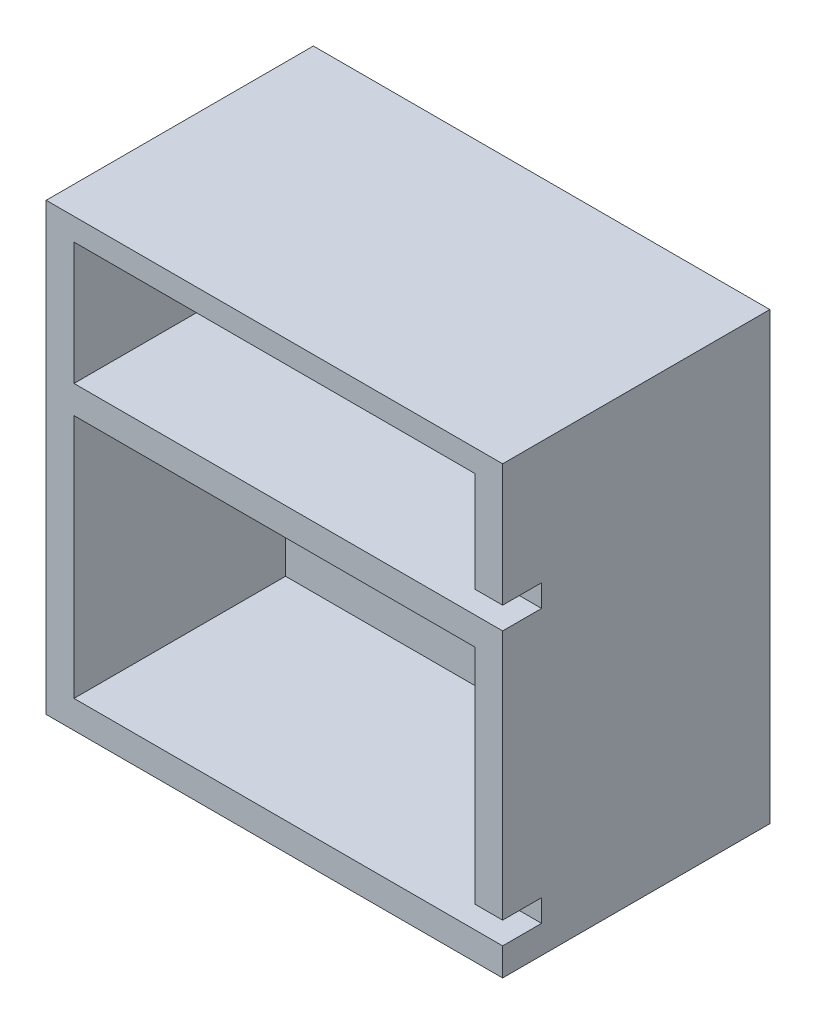
ISO-10303-21;
HEADER;
FILE_DESCRIPTION(('STEP AP214'),'2;1');
FILE_NAME('part.step','',(''),(''),'','','');
FILE_SCHEMA(('AUTOMOTIVE_DESIGN { 1 0 10303 214 1 1 1 1 }'));
ENDSEC;
DATA;
#1=APPLICATION_CONTEXT('core data for automotive mechanical design processes');
#2=APPLICATION_PROTOCOL_DEFINITION('international standard','automotive_design',2000,#1);
#3=PRODUCT_CONTEXT('',#1,'mechanical');
#4=PRODUCT('Part','Part','',(#3));
#5=PRODUCT_RELATED_PRODUCT_CATEGORY('part','',(#4));
#6=PRODUCT_DEFINITION_FORMATION('','',#4);
#7=PRODUCT_DEFINITION_CONTEXT('part definition',#1,'design');
#8=PRODUCT_DEFINITION('design','',#6,#7);
#9=PRODUCT_DEFINITION_SHAPE('','',#8);
#10=(LENGTH_UNIT() NAMED_UNIT(*) SI_UNIT(.MILLI.,.METRE.));
#11=(NAMED_UNIT(*) PLANE_ANGLE_UNIT() SI_UNIT($,.RADIAN.));
#12=(NAMED_UNIT(*) SI_UNIT($,.STERADIAN.) SOLID_ANGLE_UNIT());
#13=UNCERTAINTY_MEASURE_WITH_UNIT(LENGTH_MEASURE(1.E-05),#10,'distance_accuracy_value','');
#14=(GEOMETRIC_REPRESENTATION_CONTEXT(3) GLOBAL_UNCERTAINTY_ASSIGNED_CONTEXT((#13)) GLOBAL_UNIT_ASSIGNED_CONTEXT((#10,
#11,#12)) REPRESENTATION_CONTEXT('',''));
#15=CARTESIAN_POINT('',(0.,0.,0.));
#16=DIRECTION('',(0.,0.,1.));
#17=DIRECTION('',(1.,0.,0.));
#18=AXIS2_PLACEMENT_3D('',#15,#16,#17);
#19=CARTESIAN_POINT('',(41.,80.,-24.));
#20=DIRECTION('',(-1.,0.,0.));
#21=DIRECTION('',(0.,0.,1.));
#22=AXIS2_PLACEMENT_3D('',#19,#20,#21);
#23=PLANE('',#22);
#24=DIRECTION('',(0.,-1.,0.));
#25=VECTOR('',#24,1.);
#26=CARTESIAN_POINT('',(41.,80.,24.));
#27=LINE('',#26,#25);
#28=CARTESIAN_POINT('',(41.,54.,24.));
#29=VERTEX_POINT('',#28);
#30=CARTESIAN_POINT('',(41.,9.00000000000001,24.));
#31=VERTEX_POINT('',#30);
#32=EDGE_CURVE('E187',#29,#31,#27,.T.);
#33=ORIENTED_EDGE('',*,*,#32,.T.);
#34=DIRECTION('',(0.,0.,1.));
#35=VECTOR('',#34,1.);
#36=CARTESIAN_POINT('',(41.,9.00000000000001,17.));
#37=LINE('',#36,#35);
#38=CARTESIAN_POINT('',(41.,9.00000000000001,17.));
#39=VERTEX_POINT('',#38);
#40=EDGE_CURVE('E306',#39,#31,#37,.T.);
#41=ORIENTED_EDGE('',*,*,#40,.F.);
#42=DIRECTION('',(0.,1.,0.));
#43=VECTOR('',#42,1.);
#44=CARTESIAN_POINT('',(41.,9.00000000000001,17.));
#45=LINE('',#44,#43);
#46=CARTESIAN_POINT('',(41.,5.,17.));
#47=VERTEX_POINT('',#46);
#48=EDGE_CURVE('E178',#47,#39,#45,.T.);
#49=ORIENTED_EDGE('',*,*,#48,.F.);
#50=DIRECTION('',(0.,0.,-1.));
#51=VECTOR('',#50,1.);
#52=CARTESIAN_POINT('',(41.,5.,17.));
#53=LINE('',#52,#51);
#54=CARTESIAN_POINT('',(41.,5.,24.));
#55=VERTEX_POINT('',#54);
#56=EDGE_CURVE('E160',#55,#47,#53,.T.);
#57=ORIENTED_EDGE('',*,*,#56,.F.);
#58=CARTESIAN_POINT('',(41.,0.,24.));
#59=VERTEX_POINT('',#58);
#60=EDGE_CURVE('E174',#55,#59,#27,.T.);
#61=ORIENTED_EDGE('',*,*,#60,.T.);
#62=DIRECTION('',(0.,0.,-1.));
#63=VECTOR('',#62,1.);
#64=CARTESIAN_POINT('',(41.,0.,-24.));
#65=LINE('',#64,#63);
#66=CARTESIAN_POINT('',(41.,0.,-24.));
#67=VERTEX_POINT('',#66);
#68=EDGE_CURVE('E215',#59,#67,#65,.T.);
#69=ORIENTED_EDGE('',*,*,#68,.T.);
#70=DIRECTION('',(0.,-1.,0.));
#71=VECTOR('',#70,1.);
#72=CARTESIAN_POINT('',(41.,80.,-24.));
#73=LINE('',#72,#71);
#74=CARTESIAN_POINT('',(41.,80.,-24.));
#75=VERTEX_POINT('',#74);
#76=EDGE_CURVE('E11',#75,#67,#73,.T.);
#77=ORIENTED_EDGE('',*,*,#76,.F.);
#78=DIRECTION('',(0.,0.,-1.));
#79=VECTOR('',#78,1.);
#80=CARTESIAN_POINT('',(41.,80.,-24.));
#81=LINE('',#80,#79);
#82=CARTESIAN_POINT('',(41.,80.,24.));
#83=VERTEX_POINT('',#82);
#84=EDGE_CURVE('E214',#83,#75,#81,.T.);
#85=ORIENTED_EDGE('',*,*,#84,.F.);
#86=CARTESIAN_POINT('',(41.,58.,24.));
#87=VERTEX_POINT('',#86);
#88=EDGE_CURVE('E190',#83,#87,#27,.T.);
#89=ORIENTED_EDGE('',*,*,#88,.T.);
#90=DIRECTION('',(0.,0.,1.));
#91=VECTOR('',#90,1.);
#92=CARTESIAN_POINT('',(41.,58.,17.));
#93=LINE('',#92,#91);
#94=CARTESIAN_POINT('',(41.,58.,17.));
#95=VERTEX_POINT('',#94);
#96=EDGE_CURVE('E286',#95,#87,#93,.T.);
#97=ORIENTED_EDGE('',*,*,#96,.F.);
#98=DIRECTION('',(0.,1.,0.));
#99=VECTOR('',#98,1.);
#100=CARTESIAN_POINT('',(41.,58.,17.));
#101=LINE('',#100,#99);
#102=CARTESIAN_POINT('',(41.,54.,17.));
#103=VERTEX_POINT('',#102);
#104=EDGE_CURVE('E292',#103,#95,#101,.T.);
#105=ORIENTED_EDGE('',*,*,#104,.F.);
#106=DIRECTION('',(0.,0.,-1.));
#107=VECTOR('',#106,1.);
#108=CARTESIAN_POINT('',(41.,54.,17.));
#109=LINE('',#108,#107);
#110=EDGE_CURVE('E295',#29,#103,#109,.T.);
#111=ORIENTED_EDGE('',*,*,#110,.F.);
#112=EDGE_LOOP('',(#33,#41,#49,#57,#61,#69,#77,#85,#89,#97,#105,#111));
#113=FACE_BOUND('',#112,.T.);
#114=ADVANCED_FACE('F33',(#113),#23,.F.);
#115=CARTESIAN_POINT('',(-41.,80.,-24.));
#116=DIRECTION('',(0.,0.,1.));
#117=DIRECTION('',(1.,0.,0.));
#118=AXIS2_PLACEMENT_3D('',#115,#116,#117);
#119=PLANE('',#118);
#120=CARTESIAN_POINT('',(-20.9999999999996,24.,-24.));
#121=DIRECTION('',(0.,0.,1.));
#122=DIRECTION('',(1.,0.,0.));
#123=AXIS2_PLACEMENT_3D('',#120,#121,#122);
#124=CIRCLE('',#123,2.25);
#125=CARTESIAN_POINT('',(-18.7499999999996,24.,-24.));
#126=VERTEX_POINT('',#125);
#127=EDGE_CURVE('E345',#126,#126,#124,.F.);
#128=ORIENTED_EDGE('',*,*,#127,.F.);
#129=EDGE_LOOP('',(#128));
#130=FACE_BOUND('',#129,.T.);
#131=CARTESIAN_POINT('',(15.0000000000004,24.,-24.));
#132=DIRECTION('',(0.,0.,1.));
#133=DIRECTION('',(1.,0.,0.));
#134=AXIS2_PLACEMENT_3D('',#131,#132,#133);
#135=CIRCLE('',#134,2.25);
#136=CARTESIAN_POINT('',(17.2500000000004,24.,-24.));
#137=VERTEX_POINT('',#136);
#138=EDGE_CURVE('E352',#137,#137,#135,.F.);
#139=ORIENTED_EDGE('',*,*,#138,.F.);
#140=EDGE_LOOP('',(#139));
#141=FACE_BOUND('',#140,.T.);
#142=CARTESIAN_POINT('',(15.,60.,-24.));
#143=DIRECTION('',(0.,0.,1.));
#144=DIRECTION('',(1.,0.,0.));
#145=AXIS2_PLACEMENT_3D('',#142,#143,#144);
#146=CIRCLE('',#145,2.25);
#147=CARTESIAN_POINT('',(17.25,60.,-24.));
#148=VERTEX_POINT('',#147);
#149=EDGE_CURVE('E344',#148,#148,#146,.F.);
#150=ORIENTED_EDGE('',*,*,#149,.F.);
#151=EDGE_LOOP('',(#150));
#152=FACE_BOUND('',#151,.T.);
#153=CARTESIAN_POINT('',(-21.,60.,-24.));
#154=DIRECTION('',(0.,0.,1.));
#155=DIRECTION('',(1.,0.,0.));
#156=AXIS2_PLACEMENT_3D('',#153,#154,#155);
#157=CIRCLE('',#156,2.25);
#158=CARTESIAN_POINT('',(-18.75,60.,-24.));
#159=VERTEX_POINT('',#158);
#160=EDGE_CURVE('E325',#159,#159,#157,.F.);
#161=ORIENTED_EDGE('',*,*,#160,.F.);
#162=EDGE_LOOP('',(#161));
#163=FACE_BOUND('',#162,.T.);
#164=DIRECTION('',(-1.,0.,0.));
#165=VECTOR('',#164,1.);
#166=CARTESIAN_POINT('',(-41.,0.,-24.));
#167=LINE('',#166,#165);
#168=CARTESIAN_POINT('',(-41.,0.,-24.));
#169=VERTEX_POINT('',#168);
#170=EDGE_CURVE('E212',#67,#169,#167,.T.);
#171=ORIENTED_EDGE('',*,*,#170,.T.);
#172=DIRECTION('',(0.,-1.,0.));
#173=VECTOR('',#172,1.);
#174=CARTESIAN_POINT('',(-41.,80.,-24.));
#175=LINE('',#174,#173);
#176=CARTESIAN_POINT('',(-41.,80.,-24.));
#177=VERTEX_POINT('',#176);
#178=EDGE_CURVE('E40',#177,#169,#175,.T.);
#179=ORIENTED_EDGE('',*,*,#178,.F.);
#180=DIRECTION('',(-1.,0.,0.));
#181=VECTOR('',#180,1.);
#182=CARTESIAN_POINT('',(-41.,80.,-24.));
#183=LINE('',#182,#181);
#184=EDGE_CURVE('E221',#75,#177,#183,.T.);
#185=ORIENTED_EDGE('',*,*,#184,.F.);
#186=ORIENTED_EDGE('',*,*,#76,.T.);
#187=EDGE_LOOP('',(#171,#179,#185,#186));
#188=FACE_BOUND('',#187,.T.);
#189=ADVANCED_FACE('F374',(#130,#141,#152,#163,#188),#119,.F.);
#190=CARTESIAN_POINT('',(-41.,80.,-24.));
#191=DIRECTION('',(1.,0.,0.));
#192=DIRECTION('',(0.,0.,-1.));
#193=AXIS2_PLACEMENT_3D('',#190,#191,#192);
#194=PLANE('',#193);
#195=DIRECTION('',(0.,0.,1.));
#196=VECTOR('',#195,1.);
#197=CARTESIAN_POINT('',(-41.,0.,-24.));
#198=LINE('',#197,#196);
#199=CARTESIAN_POINT('',(-41.,0.,24.));
#200=VERTEX_POINT('',#199);
#201=EDGE_CURVE('E208',#169,#200,#198,.T.);
#202=ORIENTED_EDGE('',*,*,#201,.T.);
#203=DIRECTION('',(0.,-1.,0.));
#204=VECTOR('',#203,1.);
#205=CARTESIAN_POINT('',(-41.,80.,24.));
#206=LINE('',#205,#204);
#207=CARTESIAN_POINT('',(-41.,80.,24.));
#208=VERTEX_POINT('',#207);
#209=EDGE_CURVE('E196',#208,#200,#206,.T.);
#210=ORIENTED_EDGE('',*,*,#209,.F.);
#211=DIRECTION('',(0.,0.,1.));
#212=VECTOR('',#211,1.);
#213=CARTESIAN_POINT('',(-41.,80.,-24.));
#214=LINE('',#213,#212);
#215=EDGE_CURVE('E191',#177,#208,#214,.T.);
#216=ORIENTED_EDGE('',*,*,#215,.F.);
#217=ORIENTED_EDGE('',*,*,#178,.T.);
#218=EDGE_LOOP('',(#202,#210,#216,#217));
#219=FACE_BOUND('',#218,.T.);
#220=ADVANCED_FACE('F207',(#219),#194,.F.);
#221=CARTESIAN_POINT('',(-41.,80.,24.));
#222=DIRECTION('',(0.,0.,-1.));
#223=DIRECTION('',(-1.,0.,0.));
#224=AXIS2_PLACEMENT_3D('',#221,#222,#223);
#225=PLANE('',#224);
#226=DIRECTION('',(0.,1.,0.));
#227=VECTOR('',#226,1.);
#228=CARTESIAN_POINT('',(36.,49.,24.));
#229=LINE('',#228,#227);
#230=CARTESIAN_POINT('',(36.,9.00000000000001,24.));
#231=VERTEX_POINT('',#230);
#232=CARTESIAN_POINT('',(36.,49.,24.));
#233=VERTEX_POINT('',#232);
#234=EDGE_CURVE('E236',#231,#233,#229,.T.);
#235=ORIENTED_EDGE('',*,*,#234,.F.);
#236=DIRECTION('',(1.,0.,0.));
#237=VECTOR('',#236,1.);
#238=CARTESIAN_POINT('',(-41.001,9.00000000000001,24.));
#239=LINE('',#238,#237);
#240=EDGE_CURVE('E248',#231,#31,#239,.T.);
#241=ORIENTED_EDGE('',*,*,#240,.T.);
#242=ORIENTED_EDGE('',*,*,#32,.F.);
#243=DIRECTION('',(1.,0.,0.));
#244=VECTOR('',#243,1.);
#245=CARTESIAN_POINT('',(-36.,54.,24.));
#246=LINE('',#245,#244);
#247=CARTESIAN_POINT('',(-36.,54.,24.));
#248=VERTEX_POINT('',#247);
#249=EDGE_CURVE('E237',#248,#29,#246,.T.);
#250=ORIENTED_EDGE('',*,*,#249,.F.);
#251=DIRECTION('',(0.,-1.,0.));
#252=VECTOR('',#251,1.);
#253=CARTESIAN_POINT('',(-36.,76.,24.));
#254=LINE('',#253,#252);
#255=CARTESIAN_POINT('',(-36.,76.,24.));
#256=VERTEX_POINT('',#255);
#257=EDGE_CURVE('E240',#256,#248,#254,.T.);
#258=ORIENTED_EDGE('',*,*,#257,.F.);
#259=DIRECTION('',(-1.,0.,0.));
#260=VECTOR('',#259,1.);
#261=CARTESIAN_POINT('',(-36.,76.,24.));
#262=LINE('',#261,#260);
#263=CARTESIAN_POINT('',(36.,76.,24.));
#264=VERTEX_POINT('',#263);
#265=EDGE_CURVE('E243',#264,#256,#262,.T.);
#266=ORIENTED_EDGE('',*,*,#265,.F.);
#267=DIRECTION('',(0.,1.,0.));
#268=VECTOR('',#267,1.);
#269=CARTESIAN_POINT('',(36.,76.,24.));
#270=LINE('',#269,#268);
#271=CARTESIAN_POINT('',(36.,58.,24.));
#272=VERTEX_POINT('',#271);
#273=EDGE_CURVE('E246',#272,#264,#270,.T.);
#274=ORIENTED_EDGE('',*,*,#273,.F.);
#275=DIRECTION('',(1.,0.,0.));
#276=VECTOR('',#275,1.);
#277=CARTESIAN_POINT('',(-41.001,58.,24.));
#278=LINE('',#277,#276);
#279=EDGE_CURVE('E288',#272,#87,#278,.T.);
#280=ORIENTED_EDGE('',*,*,#279,.T.);
#281=ORIENTED_EDGE('',*,*,#88,.F.);
#282=DIRECTION('',(1.,0.,0.));
#283=VECTOR('',#282,1.);
#284=CARTESIAN_POINT('',(-41.,80.,24.));
#285=LINE('',#284,#283);
#286=EDGE_CURVE('E188',#208,#83,#285,.T.);
#287=ORIENTED_EDGE('',*,*,#286,.F.);
#288=ORIENTED_EDGE('',*,*,#209,.T.);
#289=DIRECTION('',(1.,0.,0.));
#290=VECTOR('',#289,1.);
#291=CARTESIAN_POINT('',(-41.,0.,24.));
#292=LINE('',#291,#290);
#293=EDGE_CURVE('E185',#200,#59,#292,.T.);
#294=ORIENTED_EDGE('',*,*,#293,.T.);
#295=ORIENTED_EDGE('',*,*,#60,.F.);
#296=DIRECTION('',(1.,0.,0.));
#297=VECTOR('',#296,1.);
#298=CARTESIAN_POINT('',(-36.,4.99999999999999,24.));
#299=LINE('',#298,#297);
#300=CARTESIAN_POINT('',(-36.,4.99999999999999,24.));
#301=VERTEX_POINT('',#300);
#302=EDGE_CURVE('E157',#301,#55,#299,.T.);
#303=ORIENTED_EDGE('',*,*,#302,.F.);
#304=DIRECTION('',(0.,-1.,0.));
#305=VECTOR('',#304,1.);
#306=CARTESIAN_POINT('',(-36.,49.,24.));
#307=LINE('',#306,#305);
#308=CARTESIAN_POINT('',(-36.,49.,24.));
#309=VERTEX_POINT('',#308);
#310=EDGE_CURVE('E169',#309,#301,#307,.T.);
#311=ORIENTED_EDGE('',*,*,#310,.F.);
#312=DIRECTION('',(-1.,0.,0.));
#313=VECTOR('',#312,1.);
#314=CARTESIAN_POINT('',(-36.,49.,24.));
#315=LINE('',#314,#313);
#316=EDGE_CURVE('E269',#233,#309,#315,.T.);
#317=ORIENTED_EDGE('',*,*,#316,.F.);
#318=EDGE_LOOP('',(#235,#241,#242,#250,#258,#266,#274,#280,#281,#287,#288,#294,#295,#303,#311,#317));
#319=FACE_BOUND('',#318,.T.);
#320=ADVANCED_FACE('F182',(#319),#225,.F.);
#321=CARTESIAN_POINT('',(0.,80.,0.));
#322=DIRECTION('',(0.,1.,0.));
#323=DIRECTION('',(0.,0.,1.));
#324=AXIS2_PLACEMENT_3D('',#321,#322,#323);
#325=PLANE('',#324);
#326=ORIENTED_EDGE('',*,*,#84,.T.);
#327=ORIENTED_EDGE('',*,*,#184,.T.);
#328=ORIENTED_EDGE('',*,*,#215,.T.);
#329=ORIENTED_EDGE('',*,*,#286,.T.);
#330=EDGE_LOOP('',(#326,#327,#328,#329));
#331=FACE_BOUND('',#330,.T.);
#332=ADVANCED_FACE('F381',(#331),#325,.T.);
#333=CARTESIAN_POINT('',(0.,0.,0.));
#334=DIRECTION('',(0.,1.,0.));
#335=DIRECTION('',(0.,0.,1.));
#336=AXIS2_PLACEMENT_3D('',#333,#334,#335);
#337=PLANE('',#336);
#338=ORIENTED_EDGE('',*,*,#68,.F.);
#339=ORIENTED_EDGE('',*,*,#293,.F.);
#340=ORIENTED_EDGE('',*,*,#201,.F.);
#341=ORIENTED_EDGE('',*,*,#170,.F.);
#342=EDGE_LOOP('',(#338,#339,#340,#341));
#343=FACE_BOUND('',#342,.T.);
#344=ADVANCED_FACE('F211',(#343),#337,.F.);
#345=CARTESIAN_POINT('',(36.,76.,-14.));
#346=DIRECTION('',(1.,0.,0.));
#347=DIRECTION('',(0.,1.,0.));
#348=AXIS2_PLACEMENT_3D('',#345,#346,#347);
#349=PLANE('',#348);
#350=DIRECTION('',(0.,-1.,0.));
#351=VECTOR('',#350,1.);
#352=CARTESIAN_POINT('',(36.,58.,17.));
#353=LINE('',#352,#351);
#354=CARTESIAN_POINT('',(36.,58.,17.));
#355=VERTEX_POINT('',#354);
#356=CARTESIAN_POINT('',(36.,54.,17.));
#357=VERTEX_POINT('',#356);
#358=EDGE_CURVE('E47',#355,#357,#353,.T.);
#359=ORIENTED_EDGE('',*,*,#358,.F.);
#360=DIRECTION('',(0.,0.,-1.));
#361=VECTOR('',#360,1.);
#362=CARTESIAN_POINT('',(36.,58.,17.));
#363=LINE('',#362,#361);
#364=EDGE_CURVE('E298',#272,#355,#363,.T.);
#365=ORIENTED_EDGE('',*,*,#364,.F.);
#366=ORIENTED_EDGE('',*,*,#273,.T.);
#367=DIRECTION('',(0.,0.,1.));
#368=VECTOR('',#367,1.);
#369=CARTESIAN_POINT('',(36.,76.,-14.));
#370=LINE('',#369,#368);
#371=CARTESIAN_POINT('',(36.,76.,-14.));
#372=VERTEX_POINT('',#371);
#373=EDGE_CURVE('E225',#372,#264,#370,.T.);
#374=ORIENTED_EDGE('',*,*,#373,.F.);
#375=DIRECTION('',(0.,1.,0.));
#376=VECTOR('',#375,1.);
#377=CARTESIAN_POINT('',(36.,76.,-14.));
#378=LINE('',#377,#376);
#379=CARTESIAN_POINT('',(36.,54.,-14.));
#380=VERTEX_POINT('',#379);
#381=EDGE_CURVE('E239',#380,#372,#378,.T.);
#382=ORIENTED_EDGE('',*,*,#381,.F.);
#383=DIRECTION('',(0.,0.,1.));
#384=VECTOR('',#383,1.);
#385=CARTESIAN_POINT('',(36.,54.,-14.));
#386=LINE('',#385,#384);
#387=EDGE_CURVE('E233',#380,#357,#386,.T.);
#388=ORIENTED_EDGE('',*,*,#387,.T.);
#389=EDGE_LOOP('',(#359,#365,#366,#374,#382,#388));
#390=FACE_BOUND('',#389,.T.);
#391=ADVANCED_FACE('F388',(#390),#349,.F.);
#392=CARTESIAN_POINT('',(-36.,54.,-14.));
#393=DIRECTION('',(0.,-1.,0.));
#394=DIRECTION('',(1.,0.,0.));
#395=AXIS2_PLACEMENT_3D('',#392,#393,#394);
#396=PLANE('',#395);
#397=ORIENTED_EDGE('',*,*,#249,.T.);
#398=ORIENTED_EDGE('',*,*,#110,.T.);
#399=DIRECTION('',(1.,0.,0.));
#400=VECTOR('',#399,1.);
#401=CARTESIAN_POINT('',(-41.001,54.,17.));
#402=LINE('',#401,#400);
#403=EDGE_CURVE('E283',#357,#103,#402,.T.);
#404=ORIENTED_EDGE('',*,*,#403,.F.);
#405=ORIENTED_EDGE('',*,*,#387,.F.);
#406=DIRECTION('',(1.,0.,0.));
#407=VECTOR('',#406,1.);
#408=CARTESIAN_POINT('',(-36.,54.,-14.));
#409=LINE('',#408,#407);
#410=CARTESIAN_POINT('',(-36.,54.,-14.));
#411=VERTEX_POINT('',#410);
#412=EDGE_CURVE('E229',#411,#380,#409,.T.);
#413=ORIENTED_EDGE('',*,*,#412,.F.);
#414=DIRECTION('',(0.,0.,1.));
#415=VECTOR('',#414,1.);
#416=CARTESIAN_POINT('',(-36.,54.,-14.));
#417=LINE('',#416,#415);
#418=EDGE_CURVE('E231',#411,#248,#417,.T.);
#419=ORIENTED_EDGE('',*,*,#418,.T.);
#420=EDGE_LOOP('',(#397,#398,#404,#405,#413,#419));
#421=FACE_BOUND('',#420,.T.);
#422=ADVANCED_FACE('F392',(#421),#396,.F.);
#423=CARTESIAN_POINT('',(-36.,76.,-14.));
#424=DIRECTION('',(-1.,0.,0.));
#425=DIRECTION('',(0.,-1.,0.));
#426=AXIS2_PLACEMENT_3D('',#423,#424,#425);
#427=PLANE('',#426);
#428=ORIENTED_EDGE('',*,*,#257,.T.);
#429=ORIENTED_EDGE('',*,*,#418,.F.);
#430=DIRECTION('',(0.,-1.,0.));
#431=VECTOR('',#430,1.);
#432=CARTESIAN_POINT('',(-36.,76.,-14.));
#433=LINE('',#432,#431);
#434=CARTESIAN_POINT('',(-36.,76.,-14.));
#435=VERTEX_POINT('',#434);
#436=EDGE_CURVE('E251',#435,#411,#433,.T.);
#437=ORIENTED_EDGE('',*,*,#436,.F.);
#438=DIRECTION('',(0.,0.,1.));
#439=VECTOR('',#438,1.);
#440=CARTESIAN_POINT('',(-36.,76.,-14.));
#441=LINE('',#440,#439);
#442=EDGE_CURVE('E228',#435,#256,#441,.T.);
#443=ORIENTED_EDGE('',*,*,#442,.T.);
#444=EDGE_LOOP('',(#428,#429,#437,#443));
#445=FACE_BOUND('',#444,.T.);
#446=ADVANCED_FACE('F463',(#445),#427,.F.);
#447=CARTESIAN_POINT('',(-36.,76.,-14.));
#448=DIRECTION('',(0.,1.,0.));
#449=DIRECTION('',(-1.,0.,0.));
#450=AXIS2_PLACEMENT_3D('',#447,#448,#449);
#451=PLANE('',#450);
#452=ORIENTED_EDGE('',*,*,#265,.T.);
#453=ORIENTED_EDGE('',*,*,#442,.F.);
#454=DIRECTION('',(-1.,0.,0.));
#455=VECTOR('',#454,1.);
#456=CARTESIAN_POINT('',(-36.,76.,-14.));
#457=LINE('',#456,#455);
#458=EDGE_CURVE('E254',#372,#435,#457,.T.);
#459=ORIENTED_EDGE('',*,*,#458,.F.);
#460=ORIENTED_EDGE('',*,*,#373,.T.);
#461=EDGE_LOOP('',(#452,#453,#459,#460));
#462=FACE_BOUND('',#461,.T.);
#463=ADVANCED_FACE('F470',(#462),#451,.F.);
#464=CARTESIAN_POINT('',(0.,0.,-14.));
#465=DIRECTION('',(0.,0.,1.));
#466=DIRECTION('',(1.,0.,0.));
#467=AXIS2_PLACEMENT_3D('',#464,#465,#466);
#468=PLANE('',#467);
#469=CARTESIAN_POINT('',(15.,60.,-14.));
#470=DIRECTION('',(0.,0.,1.));
#471=DIRECTION('',(1.,0.,0.));
#472=AXIS2_PLACEMENT_3D('',#469,#470,#471);
#473=CIRCLE('',#472,3.6);
#474=CARTESIAN_POINT('',(18.6,60.,-14.));
#475=VERTEX_POINT('',#474);
#476=EDGE_CURVE('E334',#475,#475,#473,.T.);
#477=ORIENTED_EDGE('',*,*,#476,.F.);
#478=EDGE_LOOP('',(#477));
#479=FACE_BOUND('',#478,.T.);
#480=CARTESIAN_POINT('',(-21.,60.,-14.));
#481=DIRECTION('',(0.,0.,1.));
#482=DIRECTION('',(1.,0.,0.));
#483=AXIS2_PLACEMENT_3D('',#480,#481,#482);
#484=CIRCLE('',#483,3.6);
#485=CARTESIAN_POINT('',(-17.4,60.,-14.));
#486=VERTEX_POINT('',#485);
#487=EDGE_CURVE('E315',#486,#486,#484,.T.);
#488=ORIENTED_EDGE('',*,*,#487,.F.);
#489=EDGE_LOOP('',(#488));
#490=FACE_BOUND('',#489,.T.);
#491=ORIENTED_EDGE('',*,*,#381,.T.);
#492=ORIENTED_EDGE('',*,*,#458,.T.);
#493=ORIENTED_EDGE('',*,*,#436,.T.);
#494=ORIENTED_EDGE('',*,*,#412,.T.);
#495=EDGE_LOOP('',(#491,#492,#493,#494));
#496=FACE_BOUND('',#495,.T.);
#497=ADVANCED_FACE('F478',(#479,#490,#496),#468,.T.);
#498=CARTESIAN_POINT('',(36.,49.,-14.));
#499=DIRECTION('',(1.,0.,0.));
#500=DIRECTION('',(0.,0.,-1.));
#501=AXIS2_PLACEMENT_3D('',#498,#499,#500);
#502=PLANE('',#501);
#503=DIRECTION('',(0.,-1.,0.));
#504=VECTOR('',#503,1.);
#505=CARTESIAN_POINT('',(36.,9.00000000000001,17.));
#506=LINE('',#505,#504);
#507=CARTESIAN_POINT('',(36.,9.00000000000001,17.));
#508=VERTEX_POINT('',#507);
#509=CARTESIAN_POINT('',(36.,5.,17.));
#510=VERTEX_POINT('',#509);
#511=EDGE_CURVE('E55',#508,#510,#506,.T.);
#512=ORIENTED_EDGE('',*,*,#511,.F.);
#513=DIRECTION('',(0.,0.,-1.));
#514=VECTOR('',#513,1.);
#515=CARTESIAN_POINT('',(36.,9.00000000000001,17.));
#516=LINE('',#515,#514);
#517=EDGE_CURVE('E179',#231,#508,#516,.T.);
#518=ORIENTED_EDGE('',*,*,#517,.F.);
#519=ORIENTED_EDGE('',*,*,#234,.T.);
#520=DIRECTION('',(0.,0.,1.));
#521=VECTOR('',#520,1.);
#522=CARTESIAN_POINT('',(36.,49.,-14.));
#523=LINE('',#522,#521);
#524=CARTESIAN_POINT('',(36.,49.,-14.));
#525=VERTEX_POINT('',#524);
#526=EDGE_CURVE('E259',#525,#233,#523,.T.);
#527=ORIENTED_EDGE('',*,*,#526,.F.);
#528=DIRECTION('',(0.,1.,0.));
#529=VECTOR('',#528,1.);
#530=CARTESIAN_POINT('',(36.,49.,-14.));
#531=LINE('',#530,#529);
#532=CARTESIAN_POINT('',(36.,5.,-14.));
#533=VERTEX_POINT('',#532);
#534=EDGE_CURVE('E168',#533,#525,#531,.T.);
#535=ORIENTED_EDGE('',*,*,#534,.F.);
#536=DIRECTION('',(0.,0.,1.));
#537=VECTOR('',#536,1.);
#538=CARTESIAN_POINT('',(36.,5.,-14.));
#539=LINE('',#538,#537);
#540=EDGE_CURVE('E218',#533,#510,#539,.T.);
#541=ORIENTED_EDGE('',*,*,#540,.T.);
#542=EDGE_LOOP('',(#512,#518,#519,#527,#535,#541));
#543=FACE_BOUND('',#542,.T.);
#544=ADVANCED_FACE('F404',(#543),#502,.F.);
#545=CARTESIAN_POINT('',(-36.,4.99999999999999,-14.));
#546=DIRECTION('',(0.,-1.,0.));
#547=DIRECTION('',(1.,0.,0.));
#548=AXIS2_PLACEMENT_3D('',#545,#546,#547);
#549=PLANE('',#548);
#550=ORIENTED_EDGE('',*,*,#302,.T.);
#551=ORIENTED_EDGE('',*,*,#56,.T.);
#552=DIRECTION('',(1.,0.,0.));
#553=VECTOR('',#552,1.);
#554=CARTESIAN_POINT('',(-41.001,5.,17.));
#555=LINE('',#554,#553);
#556=EDGE_CURVE('E303',#510,#47,#555,.T.);
#557=ORIENTED_EDGE('',*,*,#556,.F.);
#558=ORIENTED_EDGE('',*,*,#540,.F.);
#559=DIRECTION('',(1.,0.,0.));
#560=VECTOR('',#559,1.);
#561=CARTESIAN_POINT('',(-36.,4.99999999999999,-14.));
#562=LINE('',#561,#560);
#563=CARTESIAN_POINT('',(-36.,4.99999999999999,-14.));
#564=VERTEX_POINT('',#563);
#565=EDGE_CURVE('E263',#564,#533,#562,.T.);
#566=ORIENTED_EDGE('',*,*,#565,.F.);
#567=DIRECTION('',(0.,0.,1.));
#568=VECTOR('',#567,1.);
#569=CARTESIAN_POINT('',(-36.,4.99999999999999,-14.));
#570=LINE('',#569,#568);
#571=EDGE_CURVE('E163',#564,#301,#570,.T.);
#572=ORIENTED_EDGE('',*,*,#571,.T.);
#573=EDGE_LOOP('',(#550,#551,#557,#558,#566,#572));
#574=FACE_BOUND('',#573,.T.);
#575=ADVANCED_FACE('F159',(#574),#549,.F.);
#576=CARTESIAN_POINT('',(-36.,49.,-14.));
#577=DIRECTION('',(-1.,0.,0.));
#578=DIRECTION('',(0.,0.,1.));
#579=AXIS2_PLACEMENT_3D('',#576,#577,#578);
#580=PLANE('',#579);
#581=ORIENTED_EDGE('',*,*,#310,.T.);
#582=ORIENTED_EDGE('',*,*,#571,.F.);
#583=DIRECTION('',(0.,-1.,0.));
#584=VECTOR('',#583,1.);
#585=CARTESIAN_POINT('',(-36.,49.,-14.));
#586=LINE('',#585,#584);
#587=CARTESIAN_POINT('',(-36.,49.,-14.));
#588=VERTEX_POINT('',#587);
#589=EDGE_CURVE('E275',#588,#564,#586,.T.);
#590=ORIENTED_EDGE('',*,*,#589,.F.);
#591=DIRECTION('',(0.,0.,1.));
#592=VECTOR('',#591,1.);
#593=CARTESIAN_POINT('',(-36.,49.,-14.));
#594=LINE('',#593,#592);
#595=EDGE_CURVE('E262',#588,#309,#594,.T.);
#596=ORIENTED_EDGE('',*,*,#595,.T.);
#597=EDGE_LOOP('',(#581,#582,#590,#596));
#598=FACE_BOUND('',#597,.T.);
#599=ADVANCED_FACE('F501',(#598),#580,.F.);
#600=CARTESIAN_POINT('',(-36.,49.,-14.));
#601=DIRECTION('',(0.,1.,0.));
#602=DIRECTION('',(-1.,0.,0.));
#603=AXIS2_PLACEMENT_3D('',#600,#601,#602);
#604=PLANE('',#603);
#605=ORIENTED_EDGE('',*,*,#316,.T.);
#606=ORIENTED_EDGE('',*,*,#595,.F.);
#607=DIRECTION('',(-1.,0.,0.));
#608=VECTOR('',#607,1.);
#609=CARTESIAN_POINT('',(-36.,49.,-14.));
#610=LINE('',#609,#608);
#611=EDGE_CURVE('E278',#525,#588,#610,.T.);
#612=ORIENTED_EDGE('',*,*,#611,.F.);
#613=ORIENTED_EDGE('',*,*,#526,.T.);
#614=EDGE_LOOP('',(#605,#606,#612,#613));
#615=FACE_BOUND('',#614,.T.);
#616=ADVANCED_FACE('F508',(#615),#604,.F.);
#617=CARTESIAN_POINT('',(0.,0.,-14.));
#618=DIRECTION('',(0.,0.,1.));
#619=DIRECTION('',(1.,0.,0.));
#620=AXIS2_PLACEMENT_3D('',#617,#618,#619);
#621=PLANE('',#620);
#622=CARTESIAN_POINT('',(-20.9999999999996,24.,-14.));
#623=DIRECTION('',(0.,0.,1.));
#624=DIRECTION('',(1.,0.,0.));
#625=AXIS2_PLACEMENT_3D('',#622,#623,#624);
#626=CIRCLE('',#625,3.6);
#627=CARTESIAN_POINT('',(-17.3999999999996,24.,-14.));
#628=VERTEX_POINT('',#627);
#629=EDGE_CURVE('E321',#628,#628,#626,.T.);
#630=ORIENTED_EDGE('',*,*,#629,.F.);
#631=EDGE_LOOP('',(#630));
#632=FACE_BOUND('',#631,.T.);
#633=CARTESIAN_POINT('',(15.0000000000004,24.,-14.));
#634=DIRECTION('',(0.,0.,1.));
#635=DIRECTION('',(1.,0.,0.));
#636=AXIS2_PLACEMENT_3D('',#633,#634,#635);
#637=CIRCLE('',#636,3.6);
#638=CARTESIAN_POINT('',(18.6000000000004,24.,-14.));
#639=VERTEX_POINT('',#638);
#640=EDGE_CURVE('E328',#639,#639,#637,.T.);
#641=ORIENTED_EDGE('',*,*,#640,.F.);
#642=EDGE_LOOP('',(#641));
#643=FACE_BOUND('',#642,.T.);
#644=ORIENTED_EDGE('',*,*,#534,.T.);
#645=ORIENTED_EDGE('',*,*,#611,.T.);
#646=ORIENTED_EDGE('',*,*,#589,.T.);
#647=ORIENTED_EDGE('',*,*,#565,.T.);
#648=EDGE_LOOP('',(#644,#645,#646,#647));
#649=FACE_BOUND('',#648,.T.);
#650=ADVANCED_FACE('F414',(#632,#643,#649),#621,.T.);
#651=CARTESIAN_POINT('',(-41.001,9.00000000000001,17.));
#652=DIRECTION('',(0.,1.,0.));
#653=DIRECTION('',(0.,0.,1.));
#654=AXIS2_PLACEMENT_3D('',#651,#652,#653);
#655=PLANE('',#654);
#656=ORIENTED_EDGE('',*,*,#517,.T.);
#657=DIRECTION('',(1.,0.,0.));
#658=VECTOR('',#657,1.);
#659=CARTESIAN_POINT('',(-41.001,9.00000000000001,17.));
#660=LINE('',#659,#658);
#661=EDGE_CURVE('E305',#508,#39,#660,.T.);
#662=ORIENTED_EDGE('',*,*,#661,.T.);
#663=ORIENTED_EDGE('',*,*,#40,.T.);
#664=ORIENTED_EDGE('',*,*,#240,.F.);
#665=EDGE_LOOP('',(#656,#662,#663,#664));
#666=FACE_BOUND('',#665,.T.);
#667=ADVANCED_FACE('F402',(#666),#655,.F.);
#668=CARTESIAN_POINT('',(-41.001,9.00000000000001,17.));
#669=DIRECTION('',(0.,0.,-1.));
#670=DIRECTION('',(-1.,0.,0.));
#671=AXIS2_PLACEMENT_3D('',#668,#669,#670);
#672=PLANE('',#671);
#673=ORIENTED_EDGE('',*,*,#511,.T.);
#674=ORIENTED_EDGE('',*,*,#556,.T.);
#675=ORIENTED_EDGE('',*,*,#48,.T.);
#676=ORIENTED_EDGE('',*,*,#661,.F.);
#677=EDGE_LOOP('',(#673,#674,#675,#676));
#678=FACE_BOUND('',#677,.T.);
#679=ADVANCED_FACE('F406',(#678),#672,.F.);
#680=CARTESIAN_POINT('',(-41.001,58.,17.));
#681=DIRECTION('',(0.,1.,0.));
#682=DIRECTION('',(0.,0.,1.));
#683=AXIS2_PLACEMENT_3D('',#680,#681,#682);
#684=PLANE('',#683);
#685=ORIENTED_EDGE('',*,*,#364,.T.);
#686=DIRECTION('',(1.,0.,0.));
#687=VECTOR('',#686,1.);
#688=CARTESIAN_POINT('',(-41.001,58.,17.));
#689=LINE('',#688,#687);
#690=EDGE_CURVE('E285',#355,#95,#689,.T.);
#691=ORIENTED_EDGE('',*,*,#690,.T.);
#692=ORIENTED_EDGE('',*,*,#96,.T.);
#693=ORIENTED_EDGE('',*,*,#279,.F.);
#694=EDGE_LOOP('',(#685,#691,#692,#693));
#695=FACE_BOUND('',#694,.T.);
#696=ADVANCED_FACE('F386',(#695),#684,.F.);
#697=CARTESIAN_POINT('',(-41.001,58.,17.));
#698=DIRECTION('',(0.,0.,-1.));
#699=DIRECTION('',(-1.,0.,0.));
#700=AXIS2_PLACEMENT_3D('',#697,#698,#699);
#701=PLANE('',#700);
#702=ORIENTED_EDGE('',*,*,#358,.T.);
#703=ORIENTED_EDGE('',*,*,#403,.T.);
#704=ORIENTED_EDGE('',*,*,#104,.T.);
#705=ORIENTED_EDGE('',*,*,#690,.F.);
#706=EDGE_LOOP('',(#702,#703,#704,#705));
#707=FACE_BOUND('',#706,.T.);
#708=ADVANCED_FACE('F395',(#707),#701,.F.);
#709=CARTESIAN_POINT('',(15.0000000000004,24.,-18.1));
#710=DIRECTION('',(0.,0.,1.));
#711=DIRECTION('',(1.,0.,0.));
#712=AXIS2_PLACEMENT_3D('',#709,#710,#711);
#713=CYLINDRICAL_SURFACE('',#712,3.6);
#714=CARTESIAN_POINT('',(15.0000000000004,24.,-18.1));
#715=DIRECTION('',(0.,0.,1.));
#716=DIRECTION('',(1.,0.,0.));
#717=AXIS2_PLACEMENT_3D('',#714,#715,#716);
#718=CIRCLE('',#717,3.6);
#719=CARTESIAN_POINT('',(18.6000000000004,24.,-18.1));
#720=VERTEX_POINT('',#719);
#721=EDGE_CURVE('E331',#720,#720,#718,.T.);
#722=ORIENTED_EDGE('',*,*,#721,.F.);
#723=EDGE_LOOP('',(#722));
#724=FACE_BOUND('',#723,.T.);
#725=ORIENTED_EDGE('',*,*,#640,.T.);
#726=EDGE_LOOP('',(#725));
#727=FACE_BOUND('',#726,.T.);
#728=ADVANCED_FACE('F543',(#724,#727),#713,.F.);
#729=CARTESIAN_POINT('',(15.0000000000004,24.,-18.1));
#730=DIRECTION('',(0.,0.,1.));
#731=DIRECTION('',(1.,0.,0.));
#732=AXIS2_PLACEMENT_3D('',#729,#730,#731);
#733=PLANE('',#732);
#734=CARTESIAN_POINT('',(15.0000000000004,24.,-18.1));
#735=DIRECTION('',(0.,0.,1.));
#736=DIRECTION('',(1.,0.,0.));
#737=AXIS2_PLACEMENT_3D('',#734,#735,#736);
#738=CIRCLE('',#737,2.25);
#739=CARTESIAN_POINT('',(17.2500000000004,24.,-18.1));
#740=VERTEX_POINT('',#739);
#741=EDGE_CURVE('E348',#740,#740,#738,.F.);
#742=ORIENTED_EDGE('',*,*,#741,.T.);
#743=EDGE_LOOP('',(#742));
#744=FACE_BOUND('',#743,.T.);
#745=ORIENTED_EDGE('',*,*,#721,.T.);
#746=EDGE_LOOP('',(#745));
#747=FACE_BOUND('',#746,.T.);
#748=ADVANCED_FACE('F552',(#744,#747),#733,.T.);
#749=CARTESIAN_POINT('',(-20.9999999999996,24.,-18.1));
#750=DIRECTION('',(0.,0.,1.));
#751=DIRECTION('',(1.,0.,0.));
#752=AXIS2_PLACEMENT_3D('',#749,#750,#751);
#753=CYLINDRICAL_SURFACE('',#752,3.6);
#754=CARTESIAN_POINT('',(-20.9999999999996,24.,-18.1));
#755=DIRECTION('',(0.,0.,1.));
#756=DIRECTION('',(1.,0.,0.));
#757=AXIS2_PLACEMENT_3D('',#754,#755,#756);
#758=CIRCLE('',#757,3.6);
#759=CARTESIAN_POINT('',(-17.3999999999996,24.,-18.1));
#760=VERTEX_POINT('',#759);
#761=EDGE_CURVE('E324',#760,#760,#758,.T.);
#762=ORIENTED_EDGE('',*,*,#761,.F.);
#763=EDGE_LOOP('',(#762));
#764=FACE_BOUND('',#763,.T.);
#765=ORIENTED_EDGE('',*,*,#629,.T.);
#766=EDGE_LOOP('',(#765));
#767=FACE_BOUND('',#766,.T.);
#768=ADVANCED_FACE('F559',(#764,#767),#753,.F.);
#769=CARTESIAN_POINT('',(-20.9999999999996,24.,-18.1));
#770=DIRECTION('',(0.,0.,1.));
#771=DIRECTION('',(1.,0.,0.));
#772=AXIS2_PLACEMENT_3D('',#769,#770,#771);
#773=PLANE('',#772);
#774=CARTESIAN_POINT('',(-20.9999999999996,24.,-18.1));
#775=DIRECTION('',(0.,0.,1.));
#776=DIRECTION('',(1.,0.,0.));
#777=AXIS2_PLACEMENT_3D('',#774,#775,#776);
#778=CIRCLE('',#777,2.25);
#779=CARTESIAN_POINT('',(-18.7499999999996,24.,-18.1));
#780=VERTEX_POINT('',#779);
#781=EDGE_CURVE('E349',#780,#780,#778,.F.);
#782=ORIENTED_EDGE('',*,*,#781,.T.);
#783=EDGE_LOOP('',(#782));
#784=FACE_BOUND('',#783,.T.);
#785=ORIENTED_EDGE('',*,*,#761,.T.);
#786=EDGE_LOOP('',(#785));
#787=FACE_BOUND('',#786,.T.);
#788=ADVANCED_FACE('F567',(#784,#787),#773,.T.);
#789=CARTESIAN_POINT('',(-21.,60.,-18.1));
#790=DIRECTION('',(0.,0.,1.));
#791=DIRECTION('',(1.,0.,0.));
#792=AXIS2_PLACEMENT_3D('',#789,#790,#791);
#793=CYLINDRICAL_SURFACE('',#792,3.6);
#794=CARTESIAN_POINT('',(-21.,60.,-18.1));
#795=DIRECTION('',(0.,0.,1.));
#796=DIRECTION('',(1.,0.,0.));
#797=AXIS2_PLACEMENT_3D('',#794,#795,#796);
#798=CIRCLE('',#797,3.6);
#799=CARTESIAN_POINT('',(-17.4,60.,-18.1));
#800=VERTEX_POINT('',#799);
#801=EDGE_CURVE('E302',#800,#800,#798,.T.);
#802=ORIENTED_EDGE('',*,*,#801,.F.);
#803=EDGE_LOOP('',(#802));
#804=FACE_BOUND('',#803,.T.);
#805=ORIENTED_EDGE('',*,*,#487,.T.);
#806=EDGE_LOOP('',(#805));
#807=FACE_BOUND('',#806,.T.);
#808=ADVANCED_FACE('F575',(#804,#807),#793,.F.);
#809=CARTESIAN_POINT('',(-21.,60.,-18.1));
#810=DIRECTION('',(0.,0.,1.));
#811=DIRECTION('',(1.,0.,0.));
#812=AXIS2_PLACEMENT_3D('',#809,#810,#811);
#813=PLANE('',#812);
#814=CARTESIAN_POINT('',(-21.,60.,-18.1));
#815=DIRECTION('',(0.,0.,1.));
#816=DIRECTION('',(1.,0.,0.));
#817=AXIS2_PLACEMENT_3D('',#814,#815,#816);
#818=CIRCLE('',#817,2.25);
#819=CARTESIAN_POINT('',(-18.75,60.,-18.1));
#820=VERTEX_POINT('',#819);
#821=EDGE_CURVE('E341',#820,#820,#818,.F.);
#822=ORIENTED_EDGE('',*,*,#821,.T.);
#823=EDGE_LOOP('',(#822));
#824=FACE_BOUND('',#823,.T.);
#825=ORIENTED_EDGE('',*,*,#801,.T.);
#826=EDGE_LOOP('',(#825));
#827=FACE_BOUND('',#826,.T.);
#828=ADVANCED_FACE('F583',(#824,#827),#813,.T.);
#829=CARTESIAN_POINT('',(15.,60.,-18.1));
#830=DIRECTION('',(0.,0.,1.));
#831=DIRECTION('',(1.,0.,0.));
#832=AXIS2_PLACEMENT_3D('',#829,#830,#831);
#833=CYLINDRICAL_SURFACE('',#832,3.6);
#834=CARTESIAN_POINT('',(15.,60.,-18.1));
#835=DIRECTION('',(0.,0.,1.));
#836=DIRECTION('',(1.,0.,0.));
#837=AXIS2_PLACEMENT_3D('',#834,#835,#836);
#838=CIRCLE('',#837,3.6);
#839=CARTESIAN_POINT('',(18.6,60.,-18.1));
#840=VERTEX_POINT('',#839);
#841=EDGE_CURVE('E318',#840,#840,#838,.T.);
#842=ORIENTED_EDGE('',*,*,#841,.F.);
#843=EDGE_LOOP('',(#842));
#844=FACE_BOUND('',#843,.T.);
#845=ORIENTED_EDGE('',*,*,#476,.T.);
#846=EDGE_LOOP('',(#845));
#847=FACE_BOUND('',#846,.T.);
#848=ADVANCED_FACE('F590',(#844,#847),#833,.F.);
#849=CARTESIAN_POINT('',(15.,60.,-18.1));
#850=DIRECTION('',(0.,0.,1.));
#851=DIRECTION('',(1.,0.,0.));
#852=AXIS2_PLACEMENT_3D('',#849,#850,#851);
#853=PLANE('',#852);
#854=CARTESIAN_POINT('',(15.,60.,-18.1));
#855=DIRECTION('',(0.,0.,1.));
#856=DIRECTION('',(1.,0.,0.));
#857=AXIS2_PLACEMENT_3D('',#854,#855,#856);
#858=CIRCLE('',#857,2.25);
#859=CARTESIAN_POINT('',(17.25,60.,-18.1));
#860=VERTEX_POINT('',#859);
#861=EDGE_CURVE('E355',#860,#860,#858,.F.);
#862=ORIENTED_EDGE('',*,*,#861,.T.);
#863=EDGE_LOOP('',(#862));
#864=FACE_BOUND('',#863,.T.);
#865=ORIENTED_EDGE('',*,*,#841,.T.);
#866=EDGE_LOOP('',(#865));
#867=FACE_BOUND('',#866,.T.);
#868=ADVANCED_FACE('F363',(#864,#867),#853,.T.);
#869=CARTESIAN_POINT('',(-21.,60.,-24.001));
#870=DIRECTION('',(0.,0.,1.));
#871=DIRECTION('',(1.,0.,0.));
#872=AXIS2_PLACEMENT_3D('',#869,#870,#871);
#873=CYLINDRICAL_SURFACE('',#872,2.25);
#874=ORIENTED_EDGE('',*,*,#821,.F.);
#875=EDGE_LOOP('',(#874));
#876=FACE_BOUND('',#875,.T.);
#877=ORIENTED_EDGE('',*,*,#160,.T.);
#878=EDGE_LOOP('',(#877));
#879=FACE_BOUND('',#878,.T.);
#880=ADVANCED_FACE('F370',(#876,#879),#873,.F.);
#881=CARTESIAN_POINT('',(15.,60.,-24.001));
#882=DIRECTION('',(0.,0.,1.));
#883=DIRECTION('',(1.,0.,0.));
#884=AXIS2_PLACEMENT_3D('',#881,#882,#883);
#885=CYLINDRICAL_SURFACE('',#884,2.25);
#886=ORIENTED_EDGE('',*,*,#861,.F.);
#887=EDGE_LOOP('',(#886));
#888=FACE_BOUND('',#887,.T.);
#889=ORIENTED_EDGE('',*,*,#149,.T.);
#890=EDGE_LOOP('',(#889));
#891=FACE_BOUND('',#890,.T.);
#892=ADVANCED_FACE('F366',(#888,#891),#885,.F.);
#893=CARTESIAN_POINT('',(15.0000000000004,24.,-24.001));
#894=DIRECTION('',(0.,0.,1.));
#895=DIRECTION('',(1.,0.,0.));
#896=AXIS2_PLACEMENT_3D('',#893,#894,#895);
#897=CYLINDRICAL_SURFACE('',#896,2.25);
#898=ORIENTED_EDGE('',*,*,#741,.F.);
#899=EDGE_LOOP('',(#898));
#900=FACE_BOUND('',#899,.T.);
#901=ORIENTED_EDGE('',*,*,#138,.T.);
#902=EDGE_LOOP('',(#901));
#903=FACE_BOUND('',#902,.T.);
#904=ADVANCED_FACE('F369',(#900,#903),#897,.F.);
#905=CARTESIAN_POINT('',(-20.9999999999996,24.,-24.001));
#906=DIRECTION('',(0.,0.,1.));
#907=DIRECTION('',(1.,0.,0.));
#908=AXIS2_PLACEMENT_3D('',#905,#906,#907);
#909=CYLINDRICAL_SURFACE('',#908,2.25);
#910=ORIENTED_EDGE('',*,*,#781,.F.);
#911=EDGE_LOOP('',(#910));
#912=FACE_BOUND('',#911,.T.);
#913=ORIENTED_EDGE('',*,*,#127,.T.);
#914=EDGE_LOOP('',(#913));
#915=FACE_BOUND('',#914,.T.);
#916=ADVANCED_FACE('F621',(#912,#915),#909,.F.);
#917=CLOSED_SHELL('',(#114,#189,#220,#320,#332,#344,#391,#422,#446,#463,#497,#544,#575,#599,
#616,#650,#667,#679,#696,#708,#728,#748,#768,#788,#808,#828,#848,#868,#880,#892,#904,#916));
#918=MANIFOLD_SOLID_BREP('B2',#917);
#919=ADVANCED_BREP_SHAPE_REPRESENTATION('',(#18,#918),#14);
#920=SHAPE_DEFINITION_REPRESENTATION(#9,#919);
ENDSEC;
END-ISO-10303-21;
